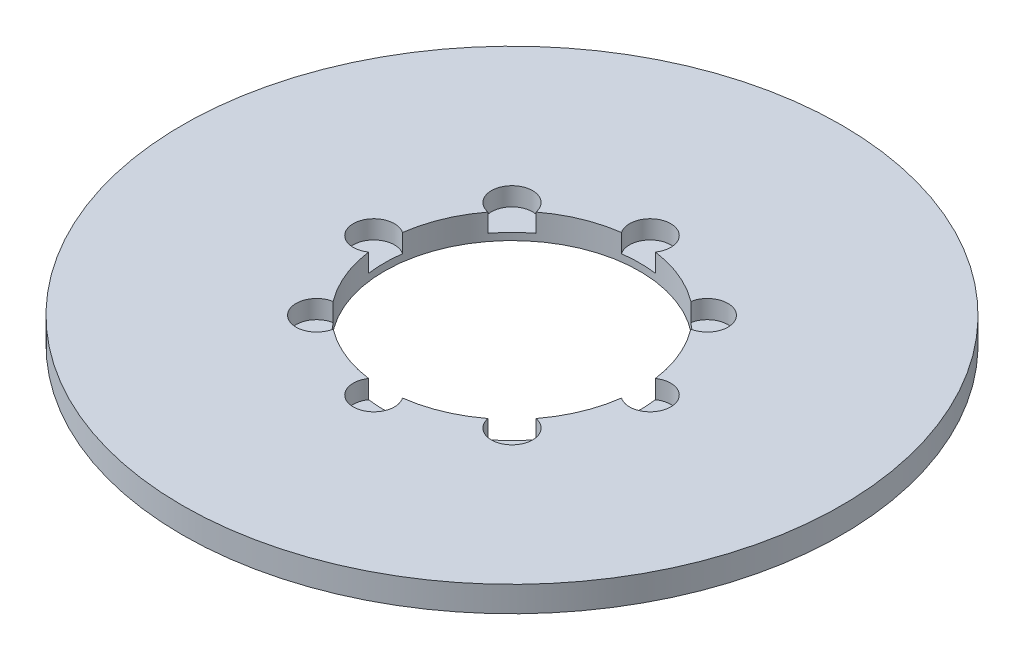
ISO-10303-21;
HEADER;
FILE_DESCRIPTION(('STEP AP214'),'2;1');
FILE_NAME('part.step','',(''),(''),'','','');
FILE_SCHEMA(('AUTOMOTIVE_DESIGN { 1 0 10303 214 1 1 1 1 }'));
ENDSEC;
DATA;
#1=APPLICATION_CONTEXT('core data for automotive mechanical design processes');
#2=APPLICATION_PROTOCOL_DEFINITION('international standard','automotive_design',2000,#1);
#3=PRODUCT_CONTEXT('',#1,'mechanical');
#4=PRODUCT('Part','Part','',(#3));
#5=PRODUCT_RELATED_PRODUCT_CATEGORY('part','',(#4));
#6=PRODUCT_DEFINITION_FORMATION('','',#4);
#7=PRODUCT_DEFINITION_CONTEXT('part definition',#1,'design');
#8=PRODUCT_DEFINITION('design','',#6,#7);
#9=PRODUCT_DEFINITION_SHAPE('','',#8);
#10=(LENGTH_UNIT() NAMED_UNIT(*) SI_UNIT(.MILLI.,.METRE.));
#11=(NAMED_UNIT(*) PLANE_ANGLE_UNIT() SI_UNIT($,.RADIAN.));
#12=(NAMED_UNIT(*) SI_UNIT($,.STERADIAN.) SOLID_ANGLE_UNIT());
#13=UNCERTAINTY_MEASURE_WITH_UNIT(LENGTH_MEASURE(1.E-05),#10,'distance_accuracy_value','');
#14=(GEOMETRIC_REPRESENTATION_CONTEXT(3) GLOBAL_UNCERTAINTY_ASSIGNED_CONTEXT((#13)) GLOBAL_UNIT_ASSIGNED_CONTEXT((#10,
#11,#12)) REPRESENTATION_CONTEXT('',''));
#15=CARTESIAN_POINT('',(0.,0.,0.));
#16=DIRECTION('',(0.,0.,1.));
#17=DIRECTION('',(1.,0.,0.));
#18=AXIS2_PLACEMENT_3D('',#15,#16,#17);
#19=CARTESIAN_POINT('',(0.,6.,0.));
#20=DIRECTION('',(0.,-1.,0.));
#21=DIRECTION('',(0.,0.,-1.));
#22=AXIS2_PLACEMENT_3D('',#19,#20,#21);
#23=CYLINDRICAL_SURFACE('',#22,77.5);
#24=CARTESIAN_POINT('',(0.,6.,0.));
#25=DIRECTION('',(0.,1.,0.));
#26=DIRECTION('',(0.,0.,1.));
#27=AXIS2_PLACEMENT_3D('',#24,#25,#26);
#28=CIRCLE('',#27,77.5);
#29=CARTESIAN_POINT('',(0.,6.,77.5));
#30=VERTEX_POINT('',#29);
#31=EDGE_CURVE('E195',#30,#30,#28,.T.);
#32=ORIENTED_EDGE('',*,*,#31,.F.);
#33=EDGE_LOOP('',(#32));
#34=FACE_BOUND('',#33,.T.);
#35=CARTESIAN_POINT('',(0.,0.,0.));
#36=DIRECTION('',(0.,1.,0.));
#37=DIRECTION('',(0.,0.,1.));
#38=AXIS2_PLACEMENT_3D('',#35,#36,#37);
#39=CIRCLE('',#38,77.5);
#40=CARTESIAN_POINT('',(0.,0.,77.5));
#41=VERTEX_POINT('',#40);
#42=EDGE_CURVE('E179',#41,#41,#39,.T.);
#43=ORIENTED_EDGE('',*,*,#42,.T.);
#44=EDGE_LOOP('',(#43));
#45=FACE_BOUND('',#44,.T.);
#46=ADVANCED_FACE('F39',(#34,#45),#23,.T.);
#47=CARTESIAN_POINT('',(0.,6.,0.));
#48=DIRECTION('',(0.,1.,0.));
#49=DIRECTION('',(0.,0.,1.));
#50=AXIS2_PLACEMENT_3D('',#47,#48,#49);
#51=PLANE('',#50);
#52=CARTESIAN_POINT('',(1.13418563561402E-13,6.,32.4843676807341));
#53=DIRECTION('',(0.,1.,0.));
#54=DIRECTION('',(1.,0.,0.));
#55=AXIS2_PLACEMENT_3D('',#52,#53,#54);
#56=CIRCLE('',#55,4.84431910051084);
#57=CARTESIAN_POINT('',(-3.9876996461896,6.,29.7337897270392));
#58=VERTEX_POINT('',#57);
#59=CARTESIAN_POINT('',(3.98769964618981,6.,29.7337897270391));
#60=VERTEX_POINT('',#59);
#61=EDGE_CURVE('E176',#58,#60,#56,.T.);
#62=ORIENTED_EDGE('',*,*,#61,.F.);
#63=CARTESIAN_POINT('',(0.,6.,0.));
#64=DIRECTION('',(0.,1.,0.));
#65=DIRECTION('',(0.,0.,1.));
#66=AXIS2_PLACEMENT_3D('',#63,#64,#65);
#67=CIRCLE('',#66,30.);
#68=CARTESIAN_POINT('',(-18.2052348852083,6.,23.8446938075202));
#69=VERTEX_POINT('',#68);
#70=EDGE_CURVE('E166',#69,#58,#67,.T.);
#71=ORIENTED_EDGE('',*,*,#70,.F.);
#72=CARTESIAN_POINT('',(-22.9699166696042,6.,22.9699166696042));
#73=DIRECTION('',(0.,1.,0.));
#74=DIRECTION('',(0.707106781186549,0.,0.707106781186546));
#75=AXIS2_PLACEMENT_3D('',#72,#73,#74);
#76=CIRCLE('',#75,4.84431910051084);
#77=CARTESIAN_POINT('',(-23.8446938075202,6.,18.2052348852084));
#78=VERTEX_POINT('',#77);
#79=EDGE_CURVE('E147',#78,#69,#76,.T.);
#80=ORIENTED_EDGE('',*,*,#79,.F.);
#81=CARTESIAN_POINT('',(-29.7337897270391,6.,3.98769964618971));
#82=VERTEX_POINT('',#81);
#83=EDGE_CURVE('E180',#82,#78,#67,.T.);
#84=ORIENTED_EDGE('',*,*,#83,.F.);
#85=CARTESIAN_POINT('',(-32.4843676807341,6.,0.));
#86=DIRECTION('',(0.,1.,0.));
#87=DIRECTION('',(0.,0.,1.));
#88=AXIS2_PLACEMENT_3D('',#85,#86,#87);
#89=CIRCLE('',#88,4.84431910051084);
#90=CARTESIAN_POINT('',(-29.7337897270391,6.,-3.98769964618971));
#91=VERTEX_POINT('',#90);
#92=EDGE_CURVE('E186',#91,#82,#89,.T.);
#93=ORIENTED_EDGE('',*,*,#92,.F.);
#94=CARTESIAN_POINT('',(-23.8446938075204,6.,-18.205234885208));
#95=VERTEX_POINT('',#94);
#96=EDGE_CURVE('E182',#95,#91,#67,.T.);
#97=ORIENTED_EDGE('',*,*,#96,.F.);
#98=CARTESIAN_POINT('',(-22.9699166696045,6.,-22.9699166696039));
#99=DIRECTION('',(0.,1.,0.));
#100=DIRECTION('',(-0.707106781186539,0.,0.707106781186556));
#101=AXIS2_PLACEMENT_3D('',#98,#99,#100);
#102=CIRCLE('',#101,4.84431910051084);
#103=CARTESIAN_POINT('',(-18.2052348852086,6.,-23.84469380752));
#104=VERTEX_POINT('',#103);
#105=EDGE_CURVE('E446',#104,#95,#102,.T.);
#106=ORIENTED_EDGE('',*,*,#105,.F.);
#107=CARTESIAN_POINT('',(-3.98769964619002,6.,-29.7337897270391));
#108=VERTEX_POINT('',#107);
#109=EDGE_CURVE('E452',#108,#104,#67,.T.);
#110=ORIENTED_EDGE('',*,*,#109,.F.);
#111=CARTESIAN_POINT('',(-3.40255690684206E-13,6.,-32.4843676807341));
#112=DIRECTION('',(0.,1.,0.));
#113=DIRECTION('',(-1.,0.,0.));
#114=AXIS2_PLACEMENT_3D('',#111,#112,#113);
#115=CIRCLE('',#114,4.84431910051084);
#116=CARTESIAN_POINT('',(3.9876996461894,6.,-29.7337897270392));
#117=VERTEX_POINT('',#116);
#118=EDGE_CURVE('E477',#117,#108,#115,.T.);
#119=ORIENTED_EDGE('',*,*,#118,.F.);
#120=CARTESIAN_POINT('',(18.2052348852081,6.,-23.8446938075204));
#121=VERTEX_POINT('',#120);
#122=EDGE_CURVE('E460',#121,#117,#67,.T.);
#123=ORIENTED_EDGE('',*,*,#122,.F.);
#124=CARTESIAN_POINT('',(22.969916669604,6.,-22.9699166696044));
#125=DIRECTION('',(0.,1.,0.));
#126=DIRECTION('',(-0.707106781186554,0.,-0.707106781186541));
#127=AXIS2_PLACEMENT_3D('',#124,#125,#126);
#128=CIRCLE('',#127,4.84431910051084);
#129=CARTESIAN_POINT('',(23.8446938075201,6.,-18.2052348852086));
#130=VERTEX_POINT('',#129);
#131=EDGE_CURVE('E464',#130,#121,#128,.T.);
#132=ORIENTED_EDGE('',*,*,#131,.F.);
#133=CARTESIAN_POINT('',(29.7337897270391,6.,-3.98769964618971));
#134=VERTEX_POINT('',#133);
#135=EDGE_CURVE('E459',#134,#130,#67,.T.);
#136=ORIENTED_EDGE('',*,*,#135,.F.);
#137=CARTESIAN_POINT('',(32.4843676807341,6.,0.));
#138=DIRECTION('',(0.,1.,0.));
#139=DIRECTION('',(0.,0.,-1.));
#140=AXIS2_PLACEMENT_3D('',#137,#138,#139);
#141=CIRCLE('',#140,4.84431910051084);
#142=CARTESIAN_POINT('',(29.7337897270391,6.,3.98769964618971));
#143=VERTEX_POINT('',#142);
#144=EDGE_CURVE('E469',#143,#134,#141,.T.);
#145=ORIENTED_EDGE('',*,*,#144,.F.);
#146=CARTESIAN_POINT('',(23.8446938075203,6.,18.2052348852082));
#147=VERTEX_POINT('',#146);
#148=EDGE_CURVE('E181',#147,#143,#67,.T.);
#149=ORIENTED_EDGE('',*,*,#148,.F.);
#150=CARTESIAN_POINT('',(22.9699166696043,6.,22.9699166696041));
#151=DIRECTION('',(0.,1.,0.));
#152=DIRECTION('',(0.707106781186544,0.,-0.707106781186551));
#153=AXIS2_PLACEMENT_3D('',#150,#151,#152);
#154=CIRCLE('',#153,4.84431910051084);
#155=CARTESIAN_POINT('',(18.2052348852085,6.,23.8446938075201));
#156=VERTEX_POINT('',#155);
#157=EDGE_CURVE('E475',#156,#147,#154,.T.);
#158=ORIENTED_EDGE('',*,*,#157,.F.);
#159=EDGE_CURVE('E177',#60,#156,#67,.T.);
#160=ORIENTED_EDGE('',*,*,#159,.F.);
#161=EDGE_LOOP('',(#62,#71,#80,#84,#93,#97,#106,#110,#119,#123,#132,#136,#145,#149,#158,#160));
#162=FACE_BOUND('',#161,.T.);
#163=ORIENTED_EDGE('',*,*,#31,.T.);
#164=EDGE_LOOP('',(#163));
#165=FACE_BOUND('',#164,.T.);
#166=ADVANCED_FACE('F172',(#162,#165),#51,.T.);
#167=CARTESIAN_POINT('',(0.,0.,0.));
#168=DIRECTION('',(0.,1.,0.));
#169=DIRECTION('',(0.,0.,1.));
#170=AXIS2_PLACEMENT_3D('',#167,#168,#169);
#171=PLANE('',#170);
#172=CARTESIAN_POINT('',(0.,0.,0.));
#173=DIRECTION('',(0.,1.,0.));
#174=DIRECTION('',(0.,0.,1.));
#175=AXIS2_PLACEMENT_3D('',#172,#173,#174);
#176=CIRCLE('',#175,30.);
#177=CARTESIAN_POINT('',(0.,0.,30.));
#178=VERTEX_POINT('',#177);
#179=EDGE_CURVE('E187',#178,#178,#176,.T.);
#180=ORIENTED_EDGE('',*,*,#179,.T.);
#181=EDGE_LOOP('',(#180));
#182=FACE_BOUND('',#181,.T.);
#183=ORIENTED_EDGE('',*,*,#42,.F.);
#184=EDGE_LOOP('',(#183));
#185=FACE_BOUND('',#184,.T.);
#186=ADVANCED_FACE('F270',(#182,#185),#171,.F.);
#187=CARTESIAN_POINT('',(0.,6.,0.));
#188=DIRECTION('',(0.,-1.,0.));
#189=DIRECTION('',(0.,0.,-1.));
#190=AXIS2_PLACEMENT_3D('',#187,#188,#189);
#191=CYLINDRICAL_SURFACE('',#190,30.);
#192=DIRECTION('',(0.,1.,0.));
#193=VECTOR('',#192,1.);
#194=CARTESIAN_POINT('',(-3.98769964618961,3.83717674369252,29.7337897270392));
#195=LINE('',#194,#193);
#196=CARTESIAN_POINT('',(-3.9876996461896,1.67435348738504,29.7337897270392));
#197=VERTEX_POINT('',#196);
#198=EDGE_CURVE('E11',#197,#58,#195,.T.);
#199=ORIENTED_EDGE('',*,*,#198,.F.);
#200=CARTESIAN_POINT('',(0.,1.67435348738504,0.));
#201=DIRECTION('',(0.,1.,0.));
#202=DIRECTION('',(0.,0.,1.));
#203=AXIS2_PLACEMENT_3D('',#200,#201,#202);
#204=CIRCLE('',#203,30.);
#205=CARTESIAN_POINT('',(3.98769964618981,1.67435348738504,29.7337897270391));
#206=VERTEX_POINT('',#205);
#207=EDGE_CURVE('E250',#197,#206,#204,.T.);
#208=ORIENTED_EDGE('',*,*,#207,.T.);
#209=DIRECTION('',(0.,1.,0.));
#210=VECTOR('',#209,1.);
#211=CARTESIAN_POINT('',(3.98769964618981,3.83717674369252,29.7337897270391));
#212=LINE('',#211,#210);
#213=EDGE_CURVE('E46',#60,#206,#212,.F.);
#214=ORIENTED_EDGE('',*,*,#213,.F.);
#215=ORIENTED_EDGE('',*,*,#159,.T.);
#216=DIRECTION('',(0.,1.,0.));
#217=VECTOR('',#216,1.);
#218=CARTESIAN_POINT('',(18.2052348852085,3.83717674369252,23.8446938075201));
#219=LINE('',#218,#217);
#220=CARTESIAN_POINT('',(18.2052348852085,1.67435348738504,23.8446938075201));
#221=VERTEX_POINT('',#220);
#222=EDGE_CURVE('E244',#221,#156,#219,.T.);
#223=ORIENTED_EDGE('',*,*,#222,.F.);
#224=CARTESIAN_POINT('',(0.,1.67435348738504,0.));
#225=DIRECTION('',(0.,1.,0.));
#226=DIRECTION('',(0.,0.,1.));
#227=AXIS2_PLACEMENT_3D('',#224,#225,#226);
#228=CIRCLE('',#227,30.);
#229=CARTESIAN_POINT('',(23.8446938075203,1.67435348738504,18.2052348852082));
#230=VERTEX_POINT('',#229);
#231=EDGE_CURVE('E238',#221,#230,#228,.T.);
#232=ORIENTED_EDGE('',*,*,#231,.T.);
#233=DIRECTION('',(0.,1.,0.));
#234=VECTOR('',#233,1.);
#235=CARTESIAN_POINT('',(23.8446938075203,3.83717674369252,18.2052348852082));
#236=LINE('',#235,#234);
#237=EDGE_CURVE('E242',#147,#230,#236,.F.);
#238=ORIENTED_EDGE('',*,*,#237,.F.);
#239=ORIENTED_EDGE('',*,*,#148,.T.);
#240=DIRECTION('',(0.,1.,0.));
#241=VECTOR('',#240,1.);
#242=CARTESIAN_POINT('',(29.7337897270392,3.83717674369252,3.98769964618971));
#243=LINE('',#242,#241);
#244=CARTESIAN_POINT('',(29.7337897270391,1.67435348738504,3.98769964618971));
#245=VERTEX_POINT('',#244);
#246=EDGE_CURVE('E236',#245,#143,#243,.T.);
#247=ORIENTED_EDGE('',*,*,#246,.F.);
#248=CARTESIAN_POINT('',(0.,1.67435348738504,0.));
#249=DIRECTION('',(0.,1.,0.));
#250=DIRECTION('',(0.,0.,1.));
#251=AXIS2_PLACEMENT_3D('',#248,#249,#250);
#252=CIRCLE('',#251,30.);
#253=CARTESIAN_POINT('',(29.7337897270391,1.67435348738504,-3.98769964618971));
#254=VERTEX_POINT('',#253);
#255=EDGE_CURVE('E235',#245,#254,#252,.T.);
#256=ORIENTED_EDGE('',*,*,#255,.T.);
#257=DIRECTION('',(0.,1.,0.));
#258=VECTOR('',#257,1.);
#259=CARTESIAN_POINT('',(29.7337897270392,3.83717674369252,-3.98769964618971));
#260=LINE('',#259,#258);
#261=EDGE_CURVE('E234',#134,#254,#260,.F.);
#262=ORIENTED_EDGE('',*,*,#261,.F.);
#263=ORIENTED_EDGE('',*,*,#135,.T.);
#264=DIRECTION('',(0.,1.,0.));
#265=VECTOR('',#264,1.);
#266=CARTESIAN_POINT('',(23.8446938075201,3.83717674369252,-18.2052348852086));
#267=LINE('',#266,#265);
#268=CARTESIAN_POINT('',(23.8446938075201,1.67435348738504,-18.2052348852086));
#269=VERTEX_POINT('',#268);
#270=EDGE_CURVE('E229',#269,#130,#267,.T.);
#271=ORIENTED_EDGE('',*,*,#270,.F.);
#272=CARTESIAN_POINT('',(0.,1.67435348738504,0.));
#273=DIRECTION('',(0.,1.,0.));
#274=DIRECTION('',(0.,0.,1.));
#275=AXIS2_PLACEMENT_3D('',#272,#273,#274);
#276=CIRCLE('',#275,30.);
#277=CARTESIAN_POINT('',(18.2052348852081,1.67435348738504,-23.8446938075204));
#278=VERTEX_POINT('',#277);
#279=EDGE_CURVE('E221',#269,#278,#276,.T.);
#280=ORIENTED_EDGE('',*,*,#279,.T.);
#281=DIRECTION('',(0.,1.,0.));
#282=VECTOR('',#281,1.);
#283=CARTESIAN_POINT('',(18.2052348852081,3.83717674369252,-23.8446938075204));
#284=LINE('',#283,#282);
#285=EDGE_CURVE('E230',#121,#278,#284,.F.);
#286=ORIENTED_EDGE('',*,*,#285,.F.);
#287=ORIENTED_EDGE('',*,*,#122,.T.);
#288=DIRECTION('',(0.,1.,0.));
#289=VECTOR('',#288,1.);
#290=CARTESIAN_POINT('',(3.9876996461894,3.83717674369252,-29.7337897270392));
#291=LINE('',#290,#289);
#292=CARTESIAN_POINT('',(3.9876996461894,1.67435348738504,-29.7337897270392));
#293=VERTEX_POINT('',#292);
#294=EDGE_CURVE('E225',#293,#117,#291,.T.);
#295=ORIENTED_EDGE('',*,*,#294,.F.);
#296=CARTESIAN_POINT('',(0.,1.67435348738504,0.));
#297=DIRECTION('',(0.,1.,0.));
#298=DIRECTION('',(0.,0.,1.));
#299=AXIS2_PLACEMENT_3D('',#296,#297,#298);
#300=CIRCLE('',#299,30.);
#301=CARTESIAN_POINT('',(-3.98769964619002,1.67435348738504,-29.7337897270391));
#302=VERTEX_POINT('',#301);
#303=EDGE_CURVE('E216',#293,#302,#300,.T.);
#304=ORIENTED_EDGE('',*,*,#303,.T.);
#305=DIRECTION('',(0.,1.,0.));
#306=VECTOR('',#305,1.);
#307=CARTESIAN_POINT('',(-3.98769964619003,3.83717674369252,-29.7337897270391));
#308=LINE('',#307,#306);
#309=EDGE_CURVE('E218',#108,#302,#308,.F.);
#310=ORIENTED_EDGE('',*,*,#309,.F.);
#311=ORIENTED_EDGE('',*,*,#109,.T.);
#312=DIRECTION('',(0.,1.,0.));
#313=VECTOR('',#312,1.);
#314=CARTESIAN_POINT('',(-18.2052348852086,3.83717674369252,-23.84469380752));
#315=LINE('',#314,#313);
#316=CARTESIAN_POINT('',(-18.2052348852086,1.67435348738504,-23.84469380752));
#317=VERTEX_POINT('',#316);
#318=EDGE_CURVE('E212',#317,#104,#315,.T.);
#319=ORIENTED_EDGE('',*,*,#318,.F.);
#320=CARTESIAN_POINT('',(0.,1.67435348738504,0.));
#321=DIRECTION('',(0.,1.,0.));
#322=DIRECTION('',(0.,0.,1.));
#323=AXIS2_PLACEMENT_3D('',#320,#321,#322);
#324=CIRCLE('',#323,30.);
#325=CARTESIAN_POINT('',(-23.8446938075204,1.67435348738504,-18.205234885208));
#326=VERTEX_POINT('',#325);
#327=EDGE_CURVE('E208',#317,#326,#324,.T.);
#328=ORIENTED_EDGE('',*,*,#327,.T.);
#329=DIRECTION('',(0.,1.,0.));
#330=VECTOR('',#329,1.);
#331=CARTESIAN_POINT('',(-23.8446938075204,3.83717674369252,-18.2052348852081));
#332=LINE('',#331,#330);
#333=EDGE_CURVE('E211',#95,#326,#332,.F.);
#334=ORIENTED_EDGE('',*,*,#333,.F.);
#335=ORIENTED_EDGE('',*,*,#96,.T.);
#336=DIRECTION('',(0.,1.,0.));
#337=VECTOR('',#336,1.);
#338=CARTESIAN_POINT('',(-29.7337897270392,3.83717674369252,-3.98769964618971));
#339=LINE('',#338,#337);
#340=CARTESIAN_POINT('',(-29.7337897270391,1.67435348738504,-3.98769964618971));
#341=VERTEX_POINT('',#340);
#342=EDGE_CURVE('E201',#341,#91,#339,.T.);
#343=ORIENTED_EDGE('',*,*,#342,.F.);
#344=CARTESIAN_POINT('',(0.,1.67435348738504,0.));
#345=DIRECTION('',(0.,1.,0.));
#346=DIRECTION('',(0.,0.,1.));
#347=AXIS2_PLACEMENT_3D('',#344,#345,#346);
#348=CIRCLE('',#347,30.);
#349=CARTESIAN_POINT('',(-29.7337897270391,1.67435348738504,3.98769964618971));
#350=VERTEX_POINT('',#349);
#351=EDGE_CURVE('E194',#341,#350,#348,.T.);
#352=ORIENTED_EDGE('',*,*,#351,.T.);
#353=DIRECTION('',(0.,1.,0.));
#354=VECTOR('',#353,1.);
#355=CARTESIAN_POINT('',(-29.7337897270392,3.83717674369252,3.98769964618971));
#356=LINE('',#355,#354);
#357=EDGE_CURVE('E199',#82,#350,#356,.F.);
#358=ORIENTED_EDGE('',*,*,#357,.F.);
#359=ORIENTED_EDGE('',*,*,#83,.T.);
#360=DIRECTION('',(0.,1.,0.));
#361=VECTOR('',#360,1.);
#362=CARTESIAN_POINT('',(-23.8446938075202,3.83717674369252,18.2052348852084));
#363=LINE('',#362,#361);
#364=CARTESIAN_POINT('',(-23.8446938075202,1.67435348738504,18.2052348852084));
#365=VERTEX_POINT('',#364);
#366=EDGE_CURVE('E160',#365,#78,#363,.T.);
#367=ORIENTED_EDGE('',*,*,#366,.F.);
#368=CARTESIAN_POINT('',(0.,1.67435348738504,0.));
#369=DIRECTION('',(0.,1.,0.));
#370=DIRECTION('',(0.,0.,1.));
#371=AXIS2_PLACEMENT_3D('',#368,#369,#370);
#372=CIRCLE('',#371,30.);
#373=CARTESIAN_POINT('',(-18.2052348852083,1.67435348738504,23.8446938075202));
#374=VERTEX_POINT('',#373);
#375=EDGE_CURVE('E168',#365,#374,#372,.T.);
#376=ORIENTED_EDGE('',*,*,#375,.T.);
#377=DIRECTION('',(0.,1.,0.));
#378=VECTOR('',#377,1.);
#379=CARTESIAN_POINT('',(-18.2052348852083,3.83717674369252,23.8446938075203));
#380=LINE('',#379,#378);
#381=EDGE_CURVE('E152',#69,#374,#380,.F.);
#382=ORIENTED_EDGE('',*,*,#381,.F.);
#383=ORIENTED_EDGE('',*,*,#70,.T.);
#384=EDGE_LOOP('',(#199,#208,#214,#215,#223,#232,#238,#239,#247,#256,#262,#263,#271,#280,#286,
#287,#295,#304,#310,#311,#319,#328,#334,#335,#343,#352,#358,#359,#367,#376,#382,#383));
#385=FACE_BOUND('',#384,.T.);
#386=ORIENTED_EDGE('',*,*,#179,.F.);
#387=EDGE_LOOP('',(#386));
#388=FACE_BOUND('',#387,.T.);
#389=ADVANCED_FACE('F170',(#385,#388),#191,.F.);
#390=CARTESIAN_POINT('',(-32.4843676807341,1.67435348738504,0.));
#391=DIRECTION('',(0.,1.,0.));
#392=DIRECTION('',(0.,0.,1.));
#393=AXIS2_PLACEMENT_3D('',#390,#391,#392);
#394=CYLINDRICAL_SURFACE('',#393,4.84431910051084);
#395=ORIENTED_EDGE('',*,*,#342,.T.);
#396=ORIENTED_EDGE('',*,*,#92,.T.);
#397=ORIENTED_EDGE('',*,*,#357,.T.);
#398=CARTESIAN_POINT('',(-32.4843676807341,1.67435348738504,0.));
#399=DIRECTION('',(0.,1.,0.));
#400=DIRECTION('',(0.,0.,1.));
#401=AXIS2_PLACEMENT_3D('',#398,#399,#400);
#402=CIRCLE('',#401,4.84431910051084);
#403=EDGE_CURVE('E191',#341,#350,#402,.T.);
#404=ORIENTED_EDGE('',*,*,#403,.F.);
#405=EDGE_LOOP('',(#395,#396,#397,#404));
#406=FACE_BOUND('',#405,.T.);
#407=ADVANCED_FACE('F279',(#406),#394,.F.);
#408=CARTESIAN_POINT('',(-32.4843676807341,1.67435348738504,0.));
#409=DIRECTION('',(0.,1.,0.));
#410=DIRECTION('',(0.,0.,1.));
#411=AXIS2_PLACEMENT_3D('',#408,#409,#410);
#412=PLANE('',#411);
#413=ORIENTED_EDGE('',*,*,#403,.T.);
#414=ORIENTED_EDGE('',*,*,#351,.F.);
#415=EDGE_LOOP('',(#413,#414));
#416=FACE_BOUND('',#415,.T.);
#417=ADVANCED_FACE('F285',(#416),#412,.T.);
#418=CARTESIAN_POINT('',(-22.9699166696042,1.67435348738504,22.9699166696042));
#419=DIRECTION('',(0.,1.,0.));
#420=DIRECTION('',(0.,0.,1.));
#421=AXIS2_PLACEMENT_3D('',#418,#419,#420);
#422=CYLINDRICAL_SURFACE('',#421,4.84431910051084);
#423=ORIENTED_EDGE('',*,*,#366,.T.);
#424=ORIENTED_EDGE('',*,*,#79,.T.);
#425=ORIENTED_EDGE('',*,*,#381,.T.);
#426=CARTESIAN_POINT('',(-22.9699166696042,1.67435348738504,22.9699166696042));
#427=DIRECTION('',(0.,1.,0.));
#428=DIRECTION('',(0.707106781186549,0.,0.707106781186546));
#429=AXIS2_PLACEMENT_3D('',#426,#427,#428);
#430=CIRCLE('',#429,4.84431910051084);
#431=EDGE_CURVE('E165',#365,#374,#430,.T.);
#432=ORIENTED_EDGE('',*,*,#431,.F.);
#433=EDGE_LOOP('',(#423,#424,#425,#432));
#434=FACE_BOUND('',#433,.T.);
#435=ADVANCED_FACE('F155',(#434),#422,.F.);
#436=CARTESIAN_POINT('',(-22.9699166696042,1.67435348738504,22.9699166696042));
#437=DIRECTION('',(0.,1.,0.));
#438=DIRECTION('',(0.707106781186549,0.,0.707106781186546));
#439=AXIS2_PLACEMENT_3D('',#436,#437,#438);
#440=PLANE('',#439);
#441=ORIENTED_EDGE('',*,*,#431,.T.);
#442=ORIENTED_EDGE('',*,*,#375,.F.);
#443=EDGE_LOOP('',(#441,#442));
#444=FACE_BOUND('',#443,.T.);
#445=ADVANCED_FACE('F288',(#444),#440,.T.);
#446=CARTESIAN_POINT('',(-22.9699166696045,1.67435348738504,-22.9699166696039));
#447=DIRECTION('',(0.,1.,0.));
#448=DIRECTION('',(0.,0.,1.));
#449=AXIS2_PLACEMENT_3D('',#446,#447,#448);
#450=CYLINDRICAL_SURFACE('',#449,4.84431910051084);
#451=ORIENTED_EDGE('',*,*,#318,.T.);
#452=ORIENTED_EDGE('',*,*,#105,.T.);
#453=ORIENTED_EDGE('',*,*,#333,.T.);
#454=CARTESIAN_POINT('',(-22.9699166696045,1.67435348738504,-22.9699166696039));
#455=DIRECTION('',(0.,1.,0.));
#456=DIRECTION('',(-0.707106781186539,0.,0.707106781186556));
#457=AXIS2_PLACEMENT_3D('',#454,#455,#456);
#458=CIRCLE('',#457,4.84431910051084);
#459=EDGE_CURVE('E447',#317,#326,#458,.T.);
#460=ORIENTED_EDGE('',*,*,#459,.F.);
#461=EDGE_LOOP('',(#451,#452,#453,#460));
#462=FACE_BOUND('',#461,.T.);
#463=ADVANCED_FACE('F295',(#462),#450,.F.);
#464=CARTESIAN_POINT('',(-22.9699166696045,1.67435348738504,-22.9699166696039));
#465=DIRECTION('',(0.,1.,0.));
#466=DIRECTION('',(-0.707106781186539,0.,0.707106781186556));
#467=AXIS2_PLACEMENT_3D('',#464,#465,#466);
#468=PLANE('',#467);
#469=ORIENTED_EDGE('',*,*,#459,.T.);
#470=ORIENTED_EDGE('',*,*,#327,.F.);
#471=EDGE_LOOP('',(#469,#470));
#472=FACE_BOUND('',#471,.T.);
#473=ADVANCED_FACE('F375',(#472),#468,.T.);
#474=CARTESIAN_POINT('',(-3.40255690684206E-13,1.67435348738504,-32.4843676807341));
#475=DIRECTION('',(0.,1.,0.));
#476=DIRECTION('',(0.,0.,1.));
#477=AXIS2_PLACEMENT_3D('',#474,#475,#476);
#478=CYLINDRICAL_SURFACE('',#477,4.84431910051084);
#479=ORIENTED_EDGE('',*,*,#294,.T.);
#480=ORIENTED_EDGE('',*,*,#118,.T.);
#481=ORIENTED_EDGE('',*,*,#309,.T.);
#482=CARTESIAN_POINT('',(-3.40255690684206E-13,1.67435348738504,-32.4843676807341));
#483=DIRECTION('',(0.,1.,0.));
#484=DIRECTION('',(-1.,0.,0.));
#485=AXIS2_PLACEMENT_3D('',#482,#483,#484);
#486=CIRCLE('',#485,4.84431910051084);
#487=EDGE_CURVE('E467',#293,#302,#486,.T.);
#488=ORIENTED_EDGE('',*,*,#487,.F.);
#489=EDGE_LOOP('',(#479,#480,#481,#488));
#490=FACE_BOUND('',#489,.T.);
#491=ADVANCED_FACE('F361',(#490),#478,.F.);
#492=CARTESIAN_POINT('',(-3.40255690684206E-13,1.67435348738504,-32.4843676807341));
#493=DIRECTION('',(0.,1.,0.));
#494=DIRECTION('',(-1.,0.,0.));
#495=AXIS2_PLACEMENT_3D('',#492,#493,#494);
#496=PLANE('',#495);
#497=ORIENTED_EDGE('',*,*,#487,.T.);
#498=ORIENTED_EDGE('',*,*,#303,.F.);
#499=EDGE_LOOP('',(#497,#498));
#500=FACE_BOUND('',#499,.T.);
#501=ADVANCED_FACE('F297',(#500),#496,.T.);
#502=CARTESIAN_POINT('',(22.969916669604,1.67435348738504,-22.9699166696044));
#503=DIRECTION('',(0.,1.,0.));
#504=DIRECTION('',(0.,0.,1.));
#505=AXIS2_PLACEMENT_3D('',#502,#503,#504);
#506=CYLINDRICAL_SURFACE('',#505,4.84431910051084);
#507=ORIENTED_EDGE('',*,*,#270,.T.);
#508=ORIENTED_EDGE('',*,*,#131,.T.);
#509=ORIENTED_EDGE('',*,*,#285,.T.);
#510=CARTESIAN_POINT('',(22.969916669604,1.67435348738504,-22.9699166696044));
#511=DIRECTION('',(0.,1.,0.));
#512=DIRECTION('',(-0.707106781186554,0.,-0.707106781186541));
#513=AXIS2_PLACEMENT_3D('',#510,#511,#512);
#514=CIRCLE('',#513,4.84431910051084);
#515=EDGE_CURVE('E470',#269,#278,#514,.T.);
#516=ORIENTED_EDGE('',*,*,#515,.F.);
#517=EDGE_LOOP('',(#507,#508,#509,#516));
#518=FACE_BOUND('',#517,.T.);
#519=ADVANCED_FACE('F294',(#518),#506,.F.);
#520=CARTESIAN_POINT('',(22.969916669604,1.67435348738504,-22.9699166696044));
#521=DIRECTION('',(0.,1.,0.));
#522=DIRECTION('',(-0.707106781186554,0.,-0.707106781186541));
#523=AXIS2_PLACEMENT_3D('',#520,#521,#522);
#524=PLANE('',#523);
#525=ORIENTED_EDGE('',*,*,#515,.T.);
#526=ORIENTED_EDGE('',*,*,#279,.F.);
#527=EDGE_LOOP('',(#525,#526));
#528=FACE_BOUND('',#527,.T.);
#529=ADVANCED_FACE('F300',(#528),#524,.T.);
#530=CARTESIAN_POINT('',(32.4843676807341,1.67435348738504,0.));
#531=DIRECTION('',(0.,1.,0.));
#532=DIRECTION('',(0.,0.,1.));
#533=AXIS2_PLACEMENT_3D('',#530,#531,#532);
#534=CYLINDRICAL_SURFACE('',#533,4.84431910051084);
#535=ORIENTED_EDGE('',*,*,#246,.T.);
#536=ORIENTED_EDGE('',*,*,#144,.T.);
#537=ORIENTED_EDGE('',*,*,#261,.T.);
#538=CARTESIAN_POINT('',(32.4843676807341,1.67435348738504,0.));
#539=DIRECTION('',(0.,1.,0.));
#540=DIRECTION('',(0.,0.,-1.));
#541=AXIS2_PLACEMENT_3D('',#538,#539,#540);
#542=CIRCLE('',#541,4.84431910051084);
#543=EDGE_CURVE('E472',#245,#254,#542,.T.);
#544=ORIENTED_EDGE('',*,*,#543,.F.);
#545=EDGE_LOOP('',(#535,#536,#537,#544));
#546=FACE_BOUND('',#545,.T.);
#547=ADVANCED_FACE('F305',(#546),#534,.F.);
#548=CARTESIAN_POINT('',(32.4843676807341,1.67435348738504,0.));
#549=DIRECTION('',(0.,1.,0.));
#550=DIRECTION('',(0.,0.,-1.));
#551=AXIS2_PLACEMENT_3D('',#548,#549,#550);
#552=PLANE('',#551);
#553=ORIENTED_EDGE('',*,*,#543,.T.);
#554=ORIENTED_EDGE('',*,*,#255,.F.);
#555=EDGE_LOOP('',(#553,#554));
#556=FACE_BOUND('',#555,.T.);
#557=ADVANCED_FACE('F308',(#556),#552,.T.);
#558=CARTESIAN_POINT('',(22.9699166696043,1.67435348738504,22.9699166696041));
#559=DIRECTION('',(0.,1.,0.));
#560=DIRECTION('',(0.,0.,1.));
#561=AXIS2_PLACEMENT_3D('',#558,#559,#560);
#562=CYLINDRICAL_SURFACE('',#561,4.84431910051084);
#563=ORIENTED_EDGE('',*,*,#222,.T.);
#564=ORIENTED_EDGE('',*,*,#157,.T.);
#565=ORIENTED_EDGE('',*,*,#237,.T.);
#566=CARTESIAN_POINT('',(22.9699166696043,1.67435348738504,22.9699166696041));
#567=DIRECTION('',(0.,1.,0.));
#568=DIRECTION('',(0.707106781186544,0.,-0.707106781186551));
#569=AXIS2_PLACEMENT_3D('',#566,#567,#568);
#570=CIRCLE('',#569,4.84431910051084);
#571=EDGE_CURVE('E56',#221,#230,#570,.T.);
#572=ORIENTED_EDGE('',*,*,#571,.F.);
#573=EDGE_LOOP('',(#563,#564,#565,#572));
#574=FACE_BOUND('',#573,.T.);
#575=ADVANCED_FACE('F309',(#574),#562,.F.);
#576=CARTESIAN_POINT('',(22.9699166696043,1.67435348738504,22.9699166696041));
#577=DIRECTION('',(0.,1.,0.));
#578=DIRECTION('',(0.707106781186544,0.,-0.707106781186551));
#579=AXIS2_PLACEMENT_3D('',#576,#577,#578);
#580=PLANE('',#579);
#581=ORIENTED_EDGE('',*,*,#571,.T.);
#582=ORIENTED_EDGE('',*,*,#231,.F.);
#583=EDGE_LOOP('',(#581,#582));
#584=FACE_BOUND('',#583,.T.);
#585=ADVANCED_FACE('F256',(#584),#580,.T.);
#586=CARTESIAN_POINT('',(1.13418563561402E-13,1.67435348738504,32.4843676807341));
#587=DIRECTION('',(0.,1.,0.));
#588=DIRECTION('',(0.,0.,1.));
#589=AXIS2_PLACEMENT_3D('',#586,#587,#588);
#590=CYLINDRICAL_SURFACE('',#589,4.84431910051084);
#591=ORIENTED_EDGE('',*,*,#198,.T.);
#592=ORIENTED_EDGE('',*,*,#61,.T.);
#593=ORIENTED_EDGE('',*,*,#213,.T.);
#594=CARTESIAN_POINT('',(1.13418563561402E-13,1.67435348738504,32.4843676807341));
#595=DIRECTION('',(0.,1.,0.));
#596=DIRECTION('',(1.,0.,0.));
#597=AXIS2_PLACEMENT_3D('',#594,#595,#596);
#598=CIRCLE('',#597,4.84431910051084);
#599=EDGE_CURVE('E55',#197,#206,#598,.T.);
#600=ORIENTED_EDGE('',*,*,#599,.F.);
#601=EDGE_LOOP('',(#591,#592,#593,#600));
#602=FACE_BOUND('',#601,.T.);
#603=ADVANCED_FACE('F253',(#602),#590,.F.);
#604=CARTESIAN_POINT('',(1.13418563561402E-13,1.67435348738504,32.4843676807341));
#605=DIRECTION('',(0.,1.,0.));
#606=DIRECTION('',(1.,0.,0.));
#607=AXIS2_PLACEMENT_3D('',#604,#605,#606);
#608=PLANE('',#607);
#609=ORIENTED_EDGE('',*,*,#599,.T.);
#610=ORIENTED_EDGE('',*,*,#207,.F.);
#611=EDGE_LOOP('',(#609,#610));
#612=FACE_BOUND('',#611,.T.);
#613=ADVANCED_FACE('F252',(#612),#608,.T.);
#614=CLOSED_SHELL('',(#46,#166,#186,#389,#407,#417,#435,#445,#463,#473,#491,#501,#519,#529,#547,
#557,#575,#585,#603,#613));
#615=MANIFOLD_SOLID_BREP('B2',#614);
#616=ADVANCED_BREP_SHAPE_REPRESENTATION('',(#18,#615),#14);
#617=SHAPE_DEFINITION_REPRESENTATION(#9,#616);
ENDSEC;
END-ISO-10303-21;
